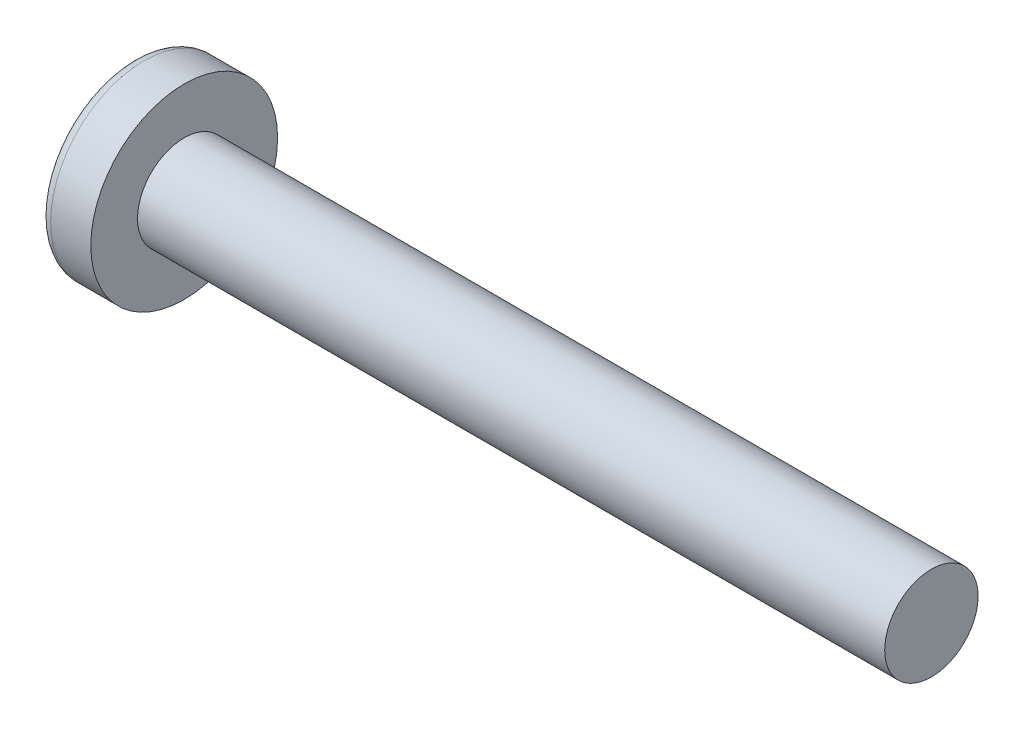
ISO-10303-21;
HEADER;
FILE_DESCRIPTION(('STEP AP214'),'2;1');
FILE_NAME('part.step','',(''),(''),'','','');
FILE_SCHEMA(('AUTOMOTIVE_DESIGN { 1 0 10303 214 1 1 1 1 }'));
ENDSEC;
DATA;
#1=APPLICATION_CONTEXT('core data for automotive mechanical design processes');
#2=APPLICATION_PROTOCOL_DEFINITION('international standard','automotive_design',2000,#1);
#3=PRODUCT_CONTEXT('',#1,'mechanical');
#4=PRODUCT('Part','Part','',(#3));
#5=PRODUCT_RELATED_PRODUCT_CATEGORY('part','',(#4));
#6=PRODUCT_DEFINITION_FORMATION('','',#4);
#7=PRODUCT_DEFINITION_CONTEXT('part definition',#1,'design');
#8=PRODUCT_DEFINITION('design','',#6,#7);
#9=PRODUCT_DEFINITION_SHAPE('','',#8);
#10=(LENGTH_UNIT() NAMED_UNIT(*) SI_UNIT(.MILLI.,.METRE.));
#11=(NAMED_UNIT(*) PLANE_ANGLE_UNIT() SI_UNIT($,.RADIAN.));
#12=(NAMED_UNIT(*) SI_UNIT($,.STERADIAN.) SOLID_ANGLE_UNIT());
#13=UNCERTAINTY_MEASURE_WITH_UNIT(LENGTH_MEASURE(1.E-05),#10,'distance_accuracy_value','');
#14=(GEOMETRIC_REPRESENTATION_CONTEXT(3) GLOBAL_UNCERTAINTY_ASSIGNED_CONTEXT((#13)) GLOBAL_UNIT_ASSIGNED_CONTEXT((#10,
#11,#12)) REPRESENTATION_CONTEXT('',''));
#15=CARTESIAN_POINT('',(0.,0.,0.));
#16=DIRECTION('',(0.,0.,1.));
#17=DIRECTION('',(1.,0.,0.));
#18=AXIS2_PLACEMENT_3D('',#15,#16,#17);
#19=CARTESIAN_POINT('',(4.,0.,0.));
#20=DIRECTION('',(-1.,0.,0.));
#21=DIRECTION('',(0.,1.,0.));
#22=AXIS2_PLACEMENT_3D('',#19,#20,#21);
#23=SPHERICAL_SURFACE('',#22,4.);
#24=CARTESIAN_POINT('',(0.783897344725726,0.,0.));
#25=DIRECTION('',(-1.,0.,0.));
#26=DIRECTION('',(0.,0.,1.));
#27=AXIS2_PLACEMENT_3D('',#24,#25,#26);
#28=CIRCLE('',#27,2.37837837837838);
#29=CARTESIAN_POINT('',(0.783897344725726,0.,2.37837837837838));
#30=VERTEX_POINT('',#29);
#31=EDGE_CURVE('E163',#30,#30,#28,.T.);
#32=ORIENTED_EDGE('',*,*,#31,.T.);
#33=EDGE_LOOP('',(#32));
#34=FACE_BOUND('',#33,.T.);
#35=CARTESIAN_POINT('',(3.98786118636742,-0.106127913473398,0.));
#36=DIRECTION('',(-0.11363816050966,-0.993522203313032,0.));
#37=DIRECTION('',(0.993522203313032,-0.11363816050966,0.));
#38=AXIS2_PLACEMENT_3D('',#35,#36,#37);
#39=CIRCLE('',#38,3.99857343501221);
#40=CARTESIAN_POINT('',(0.195539940029892,0.327634320584812,1.19110847703606));
#41=VERTEX_POINT('',#40);
#42=CARTESIAN_POINT('',(0.0301382525496408,0.346552814250857,0.346552814250858));
#43=VERTEX_POINT('',#42);
#44=EDGE_CURVE('E194',#41,#43,#39,.T.);
#45=ORIENTED_EDGE('',*,*,#44,.F.);
#46=CARTESIAN_POINT('',(3.17784904512422,0.,-1.07973473043772));
#47=DIRECTION('',(0.605808178465614,0.,0.795610740817502));
#48=DIRECTION('',(0.795610740817502,0.,-0.605808178465614));
#49=AXIS2_PLACEMENT_3D('',#46,#47,#48);
#50=CIRCLE('',#49,3.76274377539628);
#51=CARTESIAN_POINT('',(0.195539940029892,-0.327634320584821,1.19110847703606));
#52=VERTEX_POINT('',#51);
#53=EDGE_CURVE('E159',#41,#52,#50,.T.);
#54=ORIENTED_EDGE('',*,*,#53,.T.);
#55=CARTESIAN_POINT('',(3.98786118636742,0.106127913473398,0.));
#56=DIRECTION('',(-0.11363816050966,0.993522203313032,0.));
#57=DIRECTION('',(-0.993522203313032,-0.11363816050966,0.));
#58=AXIS2_PLACEMENT_3D('',#55,#56,#57);
#59=CIRCLE('',#58,3.99857343501221);
#60=CARTESIAN_POINT('',(0.0301382525496408,-0.346552814250859,0.346552814250858));
#61=VERTEX_POINT('',#60);
#62=EDGE_CURVE('E115',#61,#52,#59,.T.);
#63=ORIENTED_EDGE('',*,*,#62,.F.);
#64=CARTESIAN_POINT('',(3.98786118636742,0.,-0.106127913473398));
#65=DIRECTION('',(-0.11363816050966,0.,-0.993522203313032));
#66=DIRECTION('',(-0.993522203313032,0.,0.11363816050966));
#67=AXIS2_PLACEMENT_3D('',#64,#65,#66);
#68=CIRCLE('',#67,3.99857343501221);
#69=CARTESIAN_POINT('',(0.195539940029892,-1.19110847703606,0.327634320584816));
#70=VERTEX_POINT('',#69);
#71=EDGE_CURVE('E140',#70,#61,#68,.T.);
#72=ORIENTED_EDGE('',*,*,#71,.F.);
#73=CARTESIAN_POINT('',(3.17784904512422,1.07973473043772,0.));
#74=DIRECTION('',(0.605808178465614,-0.795610740817502,0.));
#75=DIRECTION('',(0.795610740817502,0.605808178465614,0.));
#76=AXIS2_PLACEMENT_3D('',#73,#74,#75);
#77=CIRCLE('',#76,3.76274377539628);
#78=CARTESIAN_POINT('',(0.195539940029892,-1.19110847703606,-0.327634320584816));
#79=VERTEX_POINT('',#78);
#80=EDGE_CURVE('E148',#70,#79,#77,.T.);
#81=ORIENTED_EDGE('',*,*,#80,.T.);
#82=CARTESIAN_POINT('',(3.98786118636742,0.,0.106127913473398));
#83=DIRECTION('',(-0.11363816050966,0.,0.993522203313032));
#84=DIRECTION('',(0.993522203313032,0.,0.11363816050966));
#85=AXIS2_PLACEMENT_3D('',#82,#83,#84);
#86=CIRCLE('',#85,3.99857343501221);
#87=CARTESIAN_POINT('',(0.0301382525496408,-0.346552814250857,-0.346552814250858));
#88=VERTEX_POINT('',#87);
#89=EDGE_CURVE('E58',#88,#79,#86,.T.);
#90=ORIENTED_EDGE('',*,*,#89,.F.);
#91=CARTESIAN_POINT('',(0.195539940029892,-0.327634320584812,-1.19110847703606));
#92=VERTEX_POINT('',#91);
#93=EDGE_CURVE('E201',#92,#88,#59,.T.);
#94=ORIENTED_EDGE('',*,*,#93,.F.);
#95=CARTESIAN_POINT('',(3.17784904512422,0.,1.07973473043772));
#96=DIRECTION('',(0.605808178465614,0.,-0.795610740817502));
#97=DIRECTION('',(-0.795610740817502,0.,-0.605808178465614));
#98=AXIS2_PLACEMENT_3D('',#95,#96,#97);
#99=CIRCLE('',#98,3.76274377539628);
#100=CARTESIAN_POINT('',(0.195539940029892,0.32763432058482,-1.19110847703606));
#101=VERTEX_POINT('',#100);
#102=EDGE_CURVE('E141',#92,#101,#99,.T.);
#103=ORIENTED_EDGE('',*,*,#102,.T.);
#104=CARTESIAN_POINT('',(0.0301382525496408,0.346552814250859,-0.346552814250858));
#105=VERTEX_POINT('',#104);
#106=EDGE_CURVE('E189',#105,#101,#39,.T.);
#107=ORIENTED_EDGE('',*,*,#106,.F.);
#108=CARTESIAN_POINT('',(0.195539940029892,1.19110847703606,-0.327634320584816));
#109=VERTEX_POINT('',#108);
#110=EDGE_CURVE('E51',#109,#105,#86,.T.);
#111=ORIENTED_EDGE('',*,*,#110,.F.);
#112=CARTESIAN_POINT('',(3.17784904512422,-1.07973473043772,0.));
#113=DIRECTION('',(0.605808178465614,0.795610740817502,0.));
#114=DIRECTION('',(-0.795610740817502,0.605808178465614,0.));
#115=AXIS2_PLACEMENT_3D('',#112,#113,#114);
#116=CIRCLE('',#115,3.76274377539628);
#117=CARTESIAN_POINT('',(0.195539940029892,1.19110847703606,0.327634320584816));
#118=VERTEX_POINT('',#117);
#119=EDGE_CURVE('E11',#109,#118,#116,.T.);
#120=ORIENTED_EDGE('',*,*,#119,.T.);
#121=EDGE_CURVE('E177',#43,#118,#68,.T.);
#122=ORIENTED_EDGE('',*,*,#121,.F.);
#123=EDGE_LOOP('',(#45,#54,#63,#72,#81,#90,#94,#103,#107,#111,#120,#122));
#124=FACE_BOUND('',#123,.T.);
#125=ADVANCED_FACE('F43',(#34,#124),#23,.T.);
#126=CARTESIAN_POINT('',(1.75982832618026,0.,-0.148712446351931));
#127=DIRECTION('',(-0.11363816050966,0.,0.993522203313032));
#128=DIRECTION('',(0.993522203313032,0.,0.11363816050966));
#129=AXIS2_PLACEMENT_3D('',#126,#127,#128);
#130=PLANE('',#129);
#131=ORIENTED_EDGE('',*,*,#110,.T.);
#132=DIRECTION('',(0.987168682960152,-0.112911450665377,0.112911450665377));
#133=VECTOR('',#132,1.);
#134=CARTESIAN_POINT('',(1.77640420924781,0.14681651201414,-0.146816512014139));
#135=LINE('',#134,#133);
#136=CARTESIAN_POINT('',(1.53,0.175000000000001,-0.174999999999999));
#137=VERTEX_POINT('',#136);
#138=EDGE_CURVE('E183',#105,#137,#135,.T.);
#139=ORIENTED_EDGE('',*,*,#138,.T.);
#140=DIRECTION('',(0.792336746135061,-0.603315234802187,0.0906267520089122));
#141=VECTOR('',#140,1.);
#142=CARTESIAN_POINT('',(0.,1.34,-0.35));
#143=LINE('',#142,#141);
#144=EDGE_CURVE('E164',#109,#137,#143,.T.);
#145=ORIENTED_EDGE('',*,*,#144,.F.);
#146=EDGE_LOOP('',(#131,#139,#145));
#147=FACE_BOUND('',#146,.T.);
#148=ADVANCED_FACE('F182',(#147),#130,.T.);
#149=DIRECTION('',(0.792336746135061,0.603315234802187,0.0906267520089123));
#150=VECTOR('',#149,1.);
#151=CARTESIAN_POINT('',(0.,-1.34,-0.35));
#152=LINE('',#151,#150);
#153=CARTESIAN_POINT('',(1.53,-0.175,-0.175));
#154=VERTEX_POINT('',#153);
#155=EDGE_CURVE('E149',#79,#154,#152,.T.);
#156=ORIENTED_EDGE('',*,*,#155,.T.);
#157=DIRECTION('',(-0.987168682960152,-0.112911450665376,-0.112911450665377));
#158=VECTOR('',#157,1.);
#159=CARTESIAN_POINT('',(1.77640420924781,-0.146816512014138,-0.146816512014139));
#160=LINE('',#159,#158);
#161=EDGE_CURVE('E204',#154,#88,#160,.T.);
#162=ORIENTED_EDGE('',*,*,#161,.T.);
#163=ORIENTED_EDGE('',*,*,#89,.T.);
#164=EDGE_LOOP('',(#156,#162,#163));
#165=FACE_BOUND('',#164,.T.);
#166=ADVANCED_FACE('F219',(#165),#130,.T.);
#167=CARTESIAN_POINT('',(1.75982832618026,0.,0.148712446351931));
#168=DIRECTION('',(-0.11363816050966,0.,-0.993522203313032));
#169=DIRECTION('',(-0.993522203313032,0.,0.11363816050966));
#170=AXIS2_PLACEMENT_3D('',#167,#168,#169);
#171=PLANE('',#170);
#172=DIRECTION('',(0.792336746135061,-0.603315234802187,-0.0906267520089123));
#173=VECTOR('',#172,1.);
#174=CARTESIAN_POINT('',(0.,1.34,0.35));
#175=LINE('',#174,#173);
#176=CARTESIAN_POINT('',(1.53,0.175,0.175));
#177=VERTEX_POINT('',#176);
#178=EDGE_CURVE('E220',#118,#177,#175,.T.);
#179=ORIENTED_EDGE('',*,*,#178,.T.);
#180=DIRECTION('',(-0.987168682960152,0.112911450665376,0.112911450665377));
#181=VECTOR('',#180,1.);
#182=CARTESIAN_POINT('',(1.77640420924781,0.146816512014139,0.146816512014139));
#183=LINE('',#182,#181);
#184=EDGE_CURVE('E198',#177,#43,#183,.T.);
#185=ORIENTED_EDGE('',*,*,#184,.T.);
#186=ORIENTED_EDGE('',*,*,#121,.T.);
#187=EDGE_LOOP('',(#179,#185,#186));
#188=FACE_BOUND('',#187,.T.);
#189=ADVANCED_FACE('F224',(#188),#171,.T.);
#190=ORIENTED_EDGE('',*,*,#71,.T.);
#191=DIRECTION('',(0.987168682960152,0.112911450665377,-0.112911450665377));
#192=VECTOR('',#191,1.);
#193=CARTESIAN_POINT('',(1.77640420924781,-0.14681651201414,0.146816512014139));
#194=LINE('',#193,#192);
#195=CARTESIAN_POINT('',(1.53,-0.175000000000001,0.174999999999999));
#196=VERTEX_POINT('',#195);
#197=EDGE_CURVE('E113',#61,#196,#194,.T.);
#198=ORIENTED_EDGE('',*,*,#197,.T.);
#199=DIRECTION('',(0.792336746135061,0.603315234802187,-0.0906267520089121));
#200=VECTOR('',#199,1.);
#201=CARTESIAN_POINT('',(0.,-1.34,0.35));
#202=LINE('',#201,#200);
#203=EDGE_CURVE('E138',#70,#196,#202,.T.);
#204=ORIENTED_EDGE('',*,*,#203,.F.);
#205=EDGE_LOOP('',(#190,#198,#204));
#206=FACE_BOUND('',#205,.T.);
#207=ADVANCED_FACE('F137',(#206),#171,.T.);
#208=CARTESIAN_POINT('',(-25.4,0.,0.));
#209=DIRECTION('',(-1.,0.,0.));
#210=DIRECTION('',(0.,0.,1.));
#211=AXIS2_PLACEMENT_3D('',#208,#209,#210);
#212=CYLINDRICAL_SURFACE('',#211,1.25);
#213=CARTESIAN_POINT('',(22.1,0.,0.));
#214=DIRECTION('',(-1.,0.,0.));
#215=DIRECTION('',(0.,0.,1.));
#216=AXIS2_PLACEMENT_3D('',#213,#214,#215);
#217=CIRCLE('',#216,1.25);
#218=CARTESIAN_POINT('',(22.1,0.,1.25));
#219=VERTEX_POINT('',#218);
#220=EDGE_CURVE('E160',#219,#219,#217,.T.);
#221=ORIENTED_EDGE('',*,*,#220,.T.);
#222=EDGE_LOOP('',(#221));
#223=FACE_BOUND('',#222,.T.);
#224=CARTESIAN_POINT('',(2.1,0.,0.));
#225=DIRECTION('',(-1.,0.,0.));
#226=DIRECTION('',(0.,0.,1.));
#227=AXIS2_PLACEMENT_3D('',#224,#225,#226);
#228=CIRCLE('',#227,1.25);
#229=CARTESIAN_POINT('',(2.1,0.,1.25));
#230=VERTEX_POINT('',#229);
#231=EDGE_CURVE('E173',#230,#230,#228,.T.);
#232=ORIENTED_EDGE('',*,*,#231,.F.);
#233=EDGE_LOOP('',(#232));
#234=FACE_BOUND('',#233,.T.);
#235=ADVANCED_FACE('F45',(#223,#234),#212,.T.);
#236=CARTESIAN_POINT('',(2.1,1.25,0.));
#237=DIRECTION('',(-1.,0.,0.));
#238=DIRECTION('',(0.,0.,1.));
#239=AXIS2_PLACEMENT_3D('',#236,#237,#238);
#240=PLANE('',#239);
#241=CARTESIAN_POINT('',(2.1,0.,0.));
#242=DIRECTION('',(-1.,0.,0.));
#243=DIRECTION('',(0.,0.,1.));
#244=AXIS2_PLACEMENT_3D('',#241,#242,#243);
#245=CIRCLE('',#244,2.5);
#246=CARTESIAN_POINT('',(2.1,0.,2.5));
#247=VERTEX_POINT('',#246);
#248=EDGE_CURVE('E170',#247,#247,#245,.T.);
#249=ORIENTED_EDGE('',*,*,#248,.F.);
#250=EDGE_LOOP('',(#249));
#251=FACE_BOUND('',#250,.T.);
#252=ORIENTED_EDGE('',*,*,#231,.T.);
#253=EDGE_LOOP('',(#252));
#254=FACE_BOUND('',#253,.T.);
#255=ADVANCED_FACE('F253',(#251,#254),#240,.F.);
#256=CARTESIAN_POINT('',(-25.4,0.,0.));
#257=DIRECTION('',(-1.,0.,0.));
#258=DIRECTION('',(0.,0.,1.));
#259=AXIS2_PLACEMENT_3D('',#256,#257,#258);
#260=CYLINDRICAL_SURFACE('',#259,2.5);
#261=ORIENTED_EDGE('',*,*,#248,.T.);
#262=EDGE_LOOP('',(#261));
#263=FACE_BOUND('',#262,.T.);
#264=CARTESIAN_POINT('',(1.0251050438713,0.,0.));
#265=DIRECTION('',(-1.,0.,0.));
#266=DIRECTION('',(0.,0.,1.));
#267=AXIS2_PLACEMENT_3D('',#264,#265,#266);
#268=CIRCLE('',#267,2.5);
#269=CARTESIAN_POINT('',(1.0251050438713,0.,2.5));
#270=VERTEX_POINT('',#269);
#271=EDGE_CURVE('E167',#270,#270,#268,.T.);
#272=ORIENTED_EDGE('',*,*,#271,.F.);
#273=EDGE_LOOP('',(#272));
#274=FACE_BOUND('',#273,.T.);
#275=ADVANCED_FACE('F250',(#263,#274),#260,.T.);
#276=CARTESIAN_POINT('',(1.0251050438713,0.,0.));
#277=DIRECTION('',(-1.,0.,0.));
#278=DIRECTION('',(0.,0.,1.));
#279=AXIS2_PLACEMENT_3D('',#276,#277,#278);
#280=TOROIDAL_SURFACE('',#279,2.2,0.3);
#281=ORIENTED_EDGE('',*,*,#271,.T.);
#282=EDGE_LOOP('',(#281));
#283=FACE_BOUND('',#282,.T.);
#284=ORIENTED_EDGE('',*,*,#31,.F.);
#285=EDGE_LOOP('',(#284));
#286=FACE_BOUND('',#285,.T.);
#287=ADVANCED_FACE('F247',(#283,#286),#280,.T.);
#288=CARTESIAN_POINT('',(22.1,1.25,0.));
#289=DIRECTION('',(1.,0.,0.));
#290=DIRECTION('',(0.,0.,-1.));
#291=AXIS2_PLACEMENT_3D('',#288,#289,#290);
#292=PLANE('',#291);
#293=ORIENTED_EDGE('',*,*,#220,.F.);
#294=EDGE_LOOP('',(#293));
#295=FACE_BOUND('',#294,.T.);
#296=ADVANCED_FACE('F245',(#295),#292,.T.);
#297=CARTESIAN_POINT('',(1.53,0.175,0.175));
#298=DIRECTION('',(0.605808178465614,0.795610740817502,0.));
#299=DIRECTION('',(-0.795610740817502,0.605808178465614,0.));
#300=AXIS2_PLACEMENT_3D('',#297,#298,#299);
#301=PLANE('',#300);
#302=ORIENTED_EDGE('',*,*,#144,.T.);
#303=DIRECTION('',(0.,0.,-1.));
#304=VECTOR('',#303,1.);
#305=CARTESIAN_POINT('',(1.53,0.175,0.175));
#306=LINE('',#305,#304);
#307=EDGE_CURVE('E131',#177,#137,#306,.T.);
#308=ORIENTED_EDGE('',*,*,#307,.F.);
#309=ORIENTED_EDGE('',*,*,#178,.F.);
#310=ORIENTED_EDGE('',*,*,#119,.F.);
#311=EDGE_LOOP('',(#302,#308,#309,#310));
#312=FACE_BOUND('',#311,.T.);
#313=ADVANCED_FACE('F223',(#312),#301,.F.);
#314=CARTESIAN_POINT('',(1.53,-0.175,-0.175));
#315=DIRECTION('',(0.605808178465614,-0.795610740817502,0.));
#316=DIRECTION('',(0.795610740817502,0.605808178465614,0.));
#317=AXIS2_PLACEMENT_3D('',#314,#315,#316);
#318=PLANE('',#317);
#319=ORIENTED_EDGE('',*,*,#203,.T.);
#320=DIRECTION('',(0.,0.,1.));
#321=VECTOR('',#320,1.);
#322=CARTESIAN_POINT('',(1.53,-0.175,-0.175));
#323=LINE('',#322,#321);
#324=EDGE_CURVE('E130',#154,#196,#323,.T.);
#325=ORIENTED_EDGE('',*,*,#324,.F.);
#326=ORIENTED_EDGE('',*,*,#155,.F.);
#327=ORIENTED_EDGE('',*,*,#80,.F.);
#328=EDGE_LOOP('',(#319,#325,#326,#327));
#329=FACE_BOUND('',#328,.T.);
#330=ADVANCED_FACE('F145',(#329),#318,.F.);
#331=CARTESIAN_POINT('',(1.53,-0.175,-0.175));
#332=DIRECTION('',(1.,0.,0.));
#333=DIRECTION('',(0.,0.,-1.));
#334=AXIS2_PLACEMENT_3D('',#331,#332,#333);
#335=PLANE('',#334);
#336=DIRECTION('',(0.,1.,0.));
#337=VECTOR('',#336,1.);
#338=CARTESIAN_POINT('',(1.53,-0.175,-0.175));
#339=LINE('',#338,#337);
#340=EDGE_CURVE('E153',#154,#137,#339,.T.);
#341=ORIENTED_EDGE('',*,*,#340,.F.);
#342=ORIENTED_EDGE('',*,*,#324,.T.);
#343=DIRECTION('',(0.,-1.,0.));
#344=VECTOR('',#343,1.);
#345=CARTESIAN_POINT('',(1.53,0.175,0.175));
#346=LINE('',#345,#344);
#347=EDGE_CURVE('E122',#177,#196,#346,.T.);
#348=ORIENTED_EDGE('',*,*,#347,.F.);
#349=ORIENTED_EDGE('',*,*,#307,.T.);
#350=EDGE_LOOP('',(#341,#342,#348,#349));
#351=FACE_BOUND('',#350,.T.);
#352=ADVANCED_FACE('F151',(#351),#335,.F.);
#353=CARTESIAN_POINT('',(1.53,0.175000000000001,-0.174999999999999));
#354=DIRECTION('',(0.605808178465614,0.,-0.795610740817502));
#355=DIRECTION('',(0.795610740817502,0.,0.605808178465614));
#356=AXIS2_PLACEMENT_3D('',#353,#354,#355);
#357=PLANE('',#356);
#358=DIRECTION('',(0.792336746135061,0.09062675200891,0.603315234802188));
#359=VECTOR('',#358,1.);
#360=CARTESIAN_POINT('',(0.,-0.349999999999995,-1.34));
#361=LINE('',#360,#359);
#362=EDGE_CURVE('E209',#92,#154,#361,.T.);
#363=ORIENTED_EDGE('',*,*,#362,.T.);
#364=ORIENTED_EDGE('',*,*,#340,.T.);
#365=DIRECTION('',(0.792336746135061,-0.0906267520089144,0.603315234802187));
#366=VECTOR('',#365,1.);
#367=CARTESIAN_POINT('',(0.,0.350000000000005,-1.34));
#368=LINE('',#367,#366);
#369=EDGE_CURVE('E119',#101,#137,#368,.T.);
#370=ORIENTED_EDGE('',*,*,#369,.F.);
#371=ORIENTED_EDGE('',*,*,#102,.F.);
#372=EDGE_LOOP('',(#363,#364,#370,#371));
#373=FACE_BOUND('',#372,.T.);
#374=ADVANCED_FACE('F214',(#373),#357,.F.);
#375=CARTESIAN_POINT('',(1.75982832618026,-0.148712446351931,0.));
#376=DIRECTION('',(-0.11363816050966,0.993522203313032,0.));
#377=DIRECTION('',(-0.993522203313032,-0.11363816050966,0.));
#378=AXIS2_PLACEMENT_3D('',#375,#376,#377);
#379=PLANE('',#378);
#380=ORIENTED_EDGE('',*,*,#93,.T.);
#381=ORIENTED_EDGE('',*,*,#161,.F.);
#382=ORIENTED_EDGE('',*,*,#362,.F.);
#383=EDGE_LOOP('',(#380,#381,#382));
#384=FACE_BOUND('',#383,.T.);
#385=ADVANCED_FACE('F218',(#384),#379,.T.);
#386=CARTESIAN_POINT('',(1.75982832618026,0.148712446351931,0.));
#387=DIRECTION('',(-0.11363816050966,-0.993522203313032,0.));
#388=DIRECTION('',(0.993522203313032,-0.11363816050966,0.));
#389=AXIS2_PLACEMENT_3D('',#386,#387,#388);
#390=PLANE('',#389);
#391=ORIENTED_EDGE('',*,*,#106,.T.);
#392=ORIENTED_EDGE('',*,*,#369,.T.);
#393=ORIENTED_EDGE('',*,*,#138,.F.);
#394=EDGE_LOOP('',(#391,#392,#393));
#395=FACE_BOUND('',#394,.T.);
#396=ADVANCED_FACE('F212',(#395),#390,.T.);
#397=CARTESIAN_POINT('',(1.53,-0.175000000000001,0.174999999999999));
#398=DIRECTION('',(0.605808178465614,0.,0.795610740817502));
#399=DIRECTION('',(-0.795610740817502,0.,0.605808178465614));
#400=AXIS2_PLACEMENT_3D('',#397,#398,#399);
#401=PLANE('',#400);
#402=DIRECTION('',(0.792336746135061,-0.0906267520089101,-0.603315234802188));
#403=VECTOR('',#402,1.);
#404=CARTESIAN_POINT('',(0.,0.349999999999995,1.34));
#405=LINE('',#404,#403);
#406=EDGE_CURVE('E118',#41,#177,#405,.T.);
#407=ORIENTED_EDGE('',*,*,#406,.T.);
#408=ORIENTED_EDGE('',*,*,#347,.T.);
#409=DIRECTION('',(0.792336746135061,0.0906267520089144,-0.603315234802187));
#410=VECTOR('',#409,1.);
#411=CARTESIAN_POINT('',(0.,-0.350000000000005,1.34));
#412=LINE('',#411,#410);
#413=EDGE_CURVE('E109',#52,#196,#412,.T.);
#414=ORIENTED_EDGE('',*,*,#413,.F.);
#415=ORIENTED_EDGE('',*,*,#53,.F.);
#416=EDGE_LOOP('',(#407,#408,#414,#415));
#417=FACE_BOUND('',#416,.T.);
#418=ADVANCED_FACE('F123',(#417),#401,.F.);
#419=ORIENTED_EDGE('',*,*,#44,.T.);
#420=ORIENTED_EDGE('',*,*,#184,.F.);
#421=ORIENTED_EDGE('',*,*,#406,.F.);
#422=EDGE_LOOP('',(#419,#420,#421));
#423=FACE_BOUND('',#422,.T.);
#424=ADVANCED_FACE('F225',(#423),#390,.T.);
#425=ORIENTED_EDGE('',*,*,#62,.T.);
#426=ORIENTED_EDGE('',*,*,#413,.T.);
#427=ORIENTED_EDGE('',*,*,#197,.F.);
#428=EDGE_LOOP('',(#425,#426,#427));
#429=FACE_BOUND('',#428,.T.);
#430=ADVANCED_FACE('F111',(#429),#379,.T.);
#431=CLOSED_SHELL('',(#125,#148,#166,#189,#207,#235,#255,#275,#287,#296,#313,#330,#352,#374,
#385,#396,#418,#424,#430));
#432=MANIFOLD_SOLID_BREP('B2',#431);
#433=ADVANCED_BREP_SHAPE_REPRESENTATION('',(#18,#432),#14);
#434=SHAPE_DEFINITION_REPRESENTATION(#9,#433);
ENDSEC;
END-ISO-10303-21;
